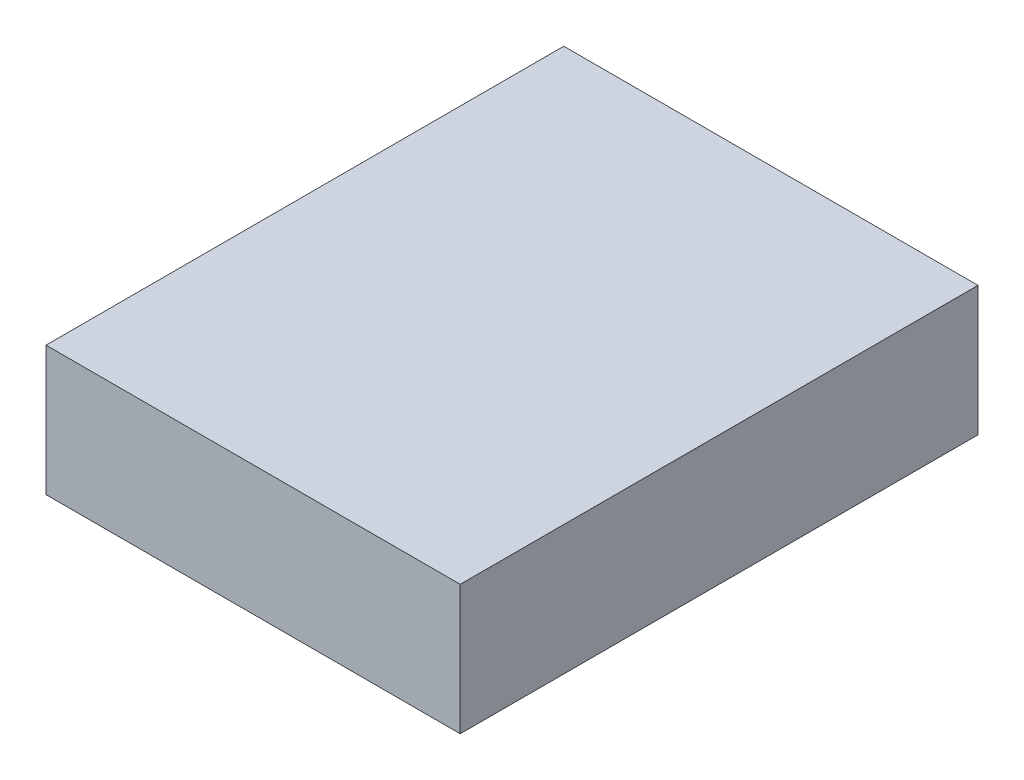
ISO-10303-21;
HEADER;
FILE_DESCRIPTION(('STEP AP214'),'2;1');
FILE_NAME('part.step','',(''),(''),'','','');
FILE_SCHEMA(('AUTOMOTIVE_DESIGN { 1 0 10303 214 1 1 1 1 }'));
ENDSEC;
DATA;
#1=APPLICATION_CONTEXT('core data for automotive mechanical design processes');
#2=APPLICATION_PROTOCOL_DEFINITION('international standard','automotive_design',2000,#1);
#3=PRODUCT_CONTEXT('',#1,'mechanical');
#4=PRODUCT('Part','Part','',(#3));
#5=PRODUCT_RELATED_PRODUCT_CATEGORY('part','',(#4));
#6=PRODUCT_DEFINITION_FORMATION('','',#4);
#7=PRODUCT_DEFINITION_CONTEXT('part definition',#1,'design');
#8=PRODUCT_DEFINITION('design','',#6,#7);
#9=PRODUCT_DEFINITION_SHAPE('','',#8);
#10=(LENGTH_UNIT() NAMED_UNIT(*) SI_UNIT(.MILLI.,.METRE.));
#11=(NAMED_UNIT(*) PLANE_ANGLE_UNIT() SI_UNIT($,.RADIAN.));
#12=(NAMED_UNIT(*) SI_UNIT($,.STERADIAN.) SOLID_ANGLE_UNIT());
#13=UNCERTAINTY_MEASURE_WITH_UNIT(LENGTH_MEASURE(1.E-05),#10,'distance_accuracy_value','');
#14=(GEOMETRIC_REPRESENTATION_CONTEXT(3) GLOBAL_UNCERTAINTY_ASSIGNED_CONTEXT((#13)) GLOBAL_UNIT_ASSIGNED_CONTEXT((#10,
#11,#12)) REPRESENTATION_CONTEXT('',''));
#15=CARTESIAN_POINT('',(0.,0.,0.));
#16=DIRECTION('',(0.,0.,1.));
#17=DIRECTION('',(1.,0.,0.));
#18=AXIS2_PLACEMENT_3D('',#15,#16,#17);
#19=CARTESIAN_POINT('',(0.,0.,508.));
#20=DIRECTION('',(1.,0.,0.));
#21=DIRECTION('',(0.,1.,0.));
#22=AXIS2_PLACEMENT_3D('',#19,#20,#21);
#23=PLANE('',#22);
#24=DIRECTION('',(0.,-1.,0.));
#25=VECTOR('',#24,1.);
#26=CARTESIAN_POINT('',(0.,0.,0.));
#27=LINE('',#26,#25);
#28=CARTESIAN_POINT('',(0.,127.,0.));
#29=VERTEX_POINT('',#28);
#30=CARTESIAN_POINT('',(0.,0.,0.));
#31=VERTEX_POINT('',#30);
#32=EDGE_CURVE('E102',#29,#31,#27,.T.);
#33=ORIENTED_EDGE('',*,*,#32,.T.);
#34=DIRECTION('',(0.,0.,-1.));
#35=VECTOR('',#34,1.);
#36=CARTESIAN_POINT('',(0.,0.,508.));
#37=LINE('',#36,#35);
#38=CARTESIAN_POINT('',(0.,0.,508.));
#39=VERTEX_POINT('',#38);
#40=EDGE_CURVE('E11',#39,#31,#37,.T.);
#41=ORIENTED_EDGE('',*,*,#40,.F.);
#42=DIRECTION('',(0.,-1.,0.));
#43=VECTOR('',#42,1.);
#44=CARTESIAN_POINT('',(0.,0.,508.));
#45=LINE('',#44,#43);
#46=CARTESIAN_POINT('',(0.,127.,508.));
#47=VERTEX_POINT('',#46);
#48=EDGE_CURVE('E90',#47,#39,#45,.T.);
#49=ORIENTED_EDGE('',*,*,#48,.F.);
#50=DIRECTION('',(0.,0.,-1.));
#51=VECTOR('',#50,1.);
#52=CARTESIAN_POINT('',(0.,127.,508.));
#53=LINE('',#52,#51);
#54=EDGE_CURVE('E98',#47,#29,#53,.T.);
#55=ORIENTED_EDGE('',*,*,#54,.T.);
#56=EDGE_LOOP('',(#33,#41,#49,#55));
#57=FACE_BOUND('',#56,.T.);
#58=ADVANCED_FACE('F39',(#57),#23,.F.);
#59=CARTESIAN_POINT('',(0.,0.,508.));
#60=DIRECTION('',(0.,1.,0.));
#61=DIRECTION('',(0.,0.,1.));
#62=AXIS2_PLACEMENT_3D('',#59,#60,#61);
#63=PLANE('',#62);
#64=DIRECTION('',(1.,0.,0.));
#65=VECTOR('',#64,1.);
#66=CARTESIAN_POINT('',(0.,0.,0.));
#67=LINE('',#66,#65);
#68=CARTESIAN_POINT('',(406.4,0.,0.));
#69=VERTEX_POINT('',#68);
#70=EDGE_CURVE('E94',#31,#69,#67,.T.);
#71=ORIENTED_EDGE('',*,*,#70,.T.);
#72=DIRECTION('',(0.,0.,-1.));
#73=VECTOR('',#72,1.);
#74=CARTESIAN_POINT('',(406.4,0.,508.));
#75=LINE('',#74,#73);
#76=CARTESIAN_POINT('',(406.4,0.,508.));
#77=VERTEX_POINT('',#76);
#78=EDGE_CURVE('E47',#77,#69,#75,.T.);
#79=ORIENTED_EDGE('',*,*,#78,.F.);
#80=DIRECTION('',(1.,0.,0.));
#81=VECTOR('',#80,1.);
#82=CARTESIAN_POINT('',(0.,0.,508.));
#83=LINE('',#82,#81);
#84=EDGE_CURVE('E85',#39,#77,#83,.T.);
#85=ORIENTED_EDGE('',*,*,#84,.F.);
#86=ORIENTED_EDGE('',*,*,#40,.T.);
#87=EDGE_LOOP('',(#71,#79,#85,#86));
#88=FACE_BOUND('',#87,.T.);
#89=ADVANCED_FACE('F93',(#88),#63,.F.);
#90=CARTESIAN_POINT('',(406.4,0.,508.));
#91=DIRECTION('',(-1.,0.,0.));
#92=DIRECTION('',(0.,-1.,0.));
#93=AXIS2_PLACEMENT_3D('',#90,#91,#92);
#94=PLANE('',#93);
#95=DIRECTION('',(0.,1.,0.));
#96=VECTOR('',#95,1.);
#97=CARTESIAN_POINT('',(406.4,0.,0.));
#98=LINE('',#97,#96);
#99=CARTESIAN_POINT('',(406.4,127.,0.));
#100=VERTEX_POINT('',#99);
#101=EDGE_CURVE('E72',#69,#100,#98,.T.);
#102=ORIENTED_EDGE('',*,*,#101,.T.);
#103=DIRECTION('',(0.,0.,-1.));
#104=VECTOR('',#103,1.);
#105=CARTESIAN_POINT('',(406.4,127.,508.));
#106=LINE('',#105,#104);
#107=CARTESIAN_POINT('',(406.4,127.,508.));
#108=VERTEX_POINT('',#107);
#109=EDGE_CURVE('E95',#108,#100,#106,.T.);
#110=ORIENTED_EDGE('',*,*,#109,.F.);
#111=DIRECTION('',(0.,1.,0.));
#112=VECTOR('',#111,1.);
#113=CARTESIAN_POINT('',(406.4,0.,508.));
#114=LINE('',#113,#112);
#115=EDGE_CURVE('E88',#77,#108,#114,.T.);
#116=ORIENTED_EDGE('',*,*,#115,.F.);
#117=ORIENTED_EDGE('',*,*,#78,.T.);
#118=EDGE_LOOP('',(#102,#110,#116,#117));
#119=FACE_BOUND('',#118,.T.);
#120=ADVANCED_FACE('F96',(#119),#94,.F.);
#121=CARTESIAN_POINT('',(0.,127.,508.));
#122=DIRECTION('',(0.,-1.,0.));
#123=DIRECTION('',(0.,0.,-1.));
#124=AXIS2_PLACEMENT_3D('',#121,#122,#123);
#125=PLANE('',#124);
#126=DIRECTION('',(-1.,0.,0.));
#127=VECTOR('',#126,1.);
#128=CARTESIAN_POINT('',(0.,127.,0.));
#129=LINE('',#128,#127);
#130=EDGE_CURVE('E78',#100,#29,#129,.T.);
#131=ORIENTED_EDGE('',*,*,#130,.T.);
#132=ORIENTED_EDGE('',*,*,#54,.F.);
#133=DIRECTION('',(-1.,0.,0.));
#134=VECTOR('',#133,1.);
#135=CARTESIAN_POINT('',(0.,127.,508.));
#136=LINE('',#135,#134);
#137=EDGE_CURVE('E55',#108,#47,#136,.T.);
#138=ORIENTED_EDGE('',*,*,#137,.F.);
#139=ORIENTED_EDGE('',*,*,#109,.T.);
#140=EDGE_LOOP('',(#131,#132,#138,#139));
#141=FACE_BOUND('',#140,.T.);
#142=ADVANCED_FACE('F109',(#141),#125,.F.);
#143=CARTESIAN_POINT('',(0.,0.,508.));
#144=DIRECTION('',(0.,0.,-1.));
#145=DIRECTION('',(-1.,0.,0.));
#146=AXIS2_PLACEMENT_3D('',#143,#144,#145);
#147=PLANE('',#146);
#148=ORIENTED_EDGE('',*,*,#48,.T.);
#149=ORIENTED_EDGE('',*,*,#84,.T.);
#150=ORIENTED_EDGE('',*,*,#115,.T.);
#151=ORIENTED_EDGE('',*,*,#137,.T.);
#152=EDGE_LOOP('',(#148,#149,#150,#151));
#153=FACE_BOUND('',#152,.T.);
#154=ADVANCED_FACE('F86',(#153),#147,.F.);
#155=CARTESIAN_POINT('',(0.,0.,0.));
#156=DIRECTION('',(0.,0.,-1.));
#157=DIRECTION('',(-1.,0.,0.));
#158=AXIS2_PLACEMENT_3D('',#155,#156,#157);
#159=PLANE('',#158);
#160=ORIENTED_EDGE('',*,*,#32,.F.);
#161=ORIENTED_EDGE('',*,*,#130,.F.);
#162=ORIENTED_EDGE('',*,*,#101,.F.);
#163=ORIENTED_EDGE('',*,*,#70,.F.);
#164=EDGE_LOOP('',(#160,#161,#162,#163));
#165=FACE_BOUND('',#164,.T.);
#166=ADVANCED_FACE('F112',(#165),#159,.T.);
#167=CLOSED_SHELL('',(#58,#89,#120,#142,#154,#166));
#168=MANIFOLD_SOLID_BREP('B2',#167);
#169=ADVANCED_BREP_SHAPE_REPRESENTATION('',(#18,#168),#14);
#170=SHAPE_DEFINITION_REPRESENTATION(#9,#169);
ENDSEC;
END-ISO-10303-21;
